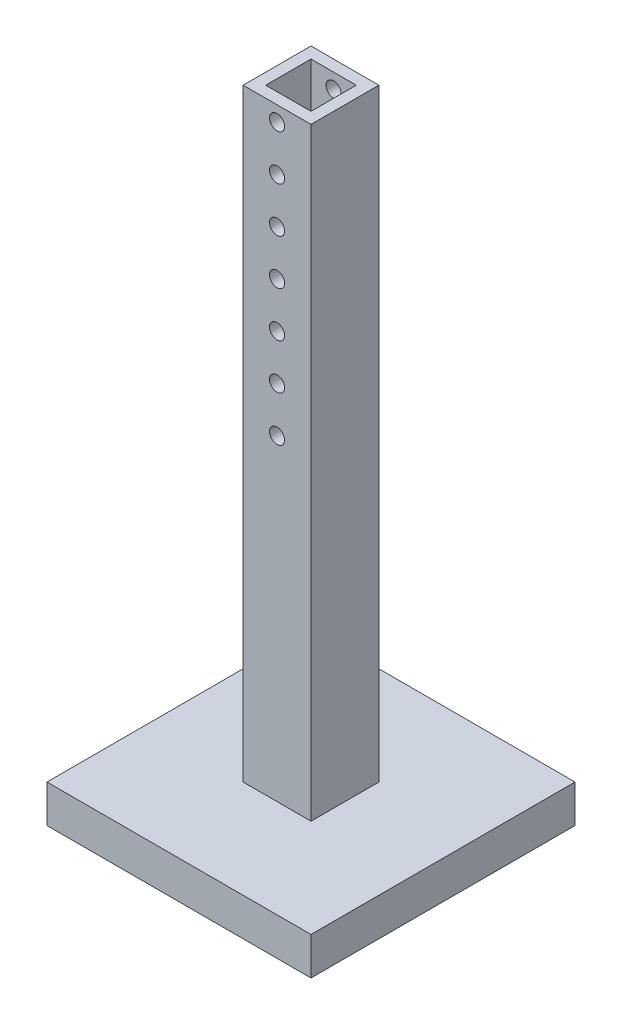
ISO-10303-21;
HEADER;
FILE_DESCRIPTION(('STEP AP214'),'2;1');
FILE_NAME('part.step','',(''),(''),'','','');
FILE_SCHEMA(('AUTOMOTIVE_DESIGN { 1 0 10303 214 1 1 1 1 }'));
ENDSEC;
DATA;
#1=APPLICATION_CONTEXT('core data for automotive mechanical design processes');
#2=APPLICATION_PROTOCOL_DEFINITION('international standard','automotive_design',2000,#1);
#3=PRODUCT_CONTEXT('',#1,'mechanical');
#4=PRODUCT('Part','Part','',(#3));
#5=PRODUCT_RELATED_PRODUCT_CATEGORY('part','',(#4));
#6=PRODUCT_DEFINITION_FORMATION('','',#4);
#7=PRODUCT_DEFINITION_CONTEXT('part definition',#1,'design');
#8=PRODUCT_DEFINITION('design','',#6,#7);
#9=PRODUCT_DEFINITION_SHAPE('','',#8);
#10=(LENGTH_UNIT() NAMED_UNIT(*) SI_UNIT(.MILLI.,.METRE.));
#11=(NAMED_UNIT(*) PLANE_ANGLE_UNIT() SI_UNIT($,.RADIAN.));
#12=(NAMED_UNIT(*) SI_UNIT($,.STERADIAN.) SOLID_ANGLE_UNIT());
#13=UNCERTAINTY_MEASURE_WITH_UNIT(LENGTH_MEASURE(1.E-05),#10,'distance_accuracy_value','');
#14=(GEOMETRIC_REPRESENTATION_CONTEXT(3) GLOBAL_UNCERTAINTY_ASSIGNED_CONTEXT((#13)) GLOBAL_UNIT_ASSIGNED_CONTEXT((#10,
#11,#12)) REPRESENTATION_CONTEXT('',''));
#15=CARTESIAN_POINT('',(0.,0.,0.));
#16=DIRECTION('',(0.,0.,1.));
#17=DIRECTION('',(1.,0.,0.));
#18=AXIS2_PLACEMENT_3D('',#15,#16,#17);
#19=CARTESIAN_POINT('',(175.,50.,-175.));
#20=DIRECTION('',(-1.,0.,0.));
#21=DIRECTION('',(0.,0.,1.));
#22=AXIS2_PLACEMENT_3D('',#19,#20,#21);
#23=PLANE('',#22);
#24=DIRECTION('',(0.,0.,-1.));
#25=VECTOR('',#24,1.);
#26=CARTESIAN_POINT('',(175.,0.,-175.));
#27=LINE('',#26,#25);
#28=CARTESIAN_POINT('',(175.,0.,175.));
#29=VERTEX_POINT('',#28);
#30=CARTESIAN_POINT('',(175.,0.,-175.));
#31=VERTEX_POINT('',#30);
#32=EDGE_CURVE('E226',#29,#31,#27,.T.);
#33=ORIENTED_EDGE('',*,*,#32,.T.);
#34=DIRECTION('',(0.,-1.,0.));
#35=VECTOR('',#34,1.);
#36=CARTESIAN_POINT('',(175.,50.,-175.));
#37=LINE('',#36,#35);
#38=CARTESIAN_POINT('',(175.,50.,-175.));
#39=VERTEX_POINT('',#38);
#40=EDGE_CURVE('E11',#39,#31,#37,.T.);
#41=ORIENTED_EDGE('',*,*,#40,.F.);
#42=DIRECTION('',(0.,0.,-1.));
#43=VECTOR('',#42,1.);
#44=CARTESIAN_POINT('',(175.,50.,-175.));
#45=LINE('',#44,#43);
#46=CARTESIAN_POINT('',(175.,50.,175.));
#47=VERTEX_POINT('',#46);
#48=EDGE_CURVE('E227',#47,#39,#45,.T.);
#49=ORIENTED_EDGE('',*,*,#48,.F.);
#50=DIRECTION('',(0.,-1.,0.));
#51=VECTOR('',#50,1.);
#52=CARTESIAN_POINT('',(175.,50.,175.));
#53=LINE('',#52,#51);
#54=EDGE_CURVE('E241',#47,#29,#53,.T.);
#55=ORIENTED_EDGE('',*,*,#54,.T.);
#56=EDGE_LOOP('',(#33,#41,#49,#55));
#57=FACE_BOUND('',#56,.T.);
#58=ADVANCED_FACE('F40',(#57),#23,.F.);
#59=CARTESIAN_POINT('',(-175.,50.,-175.));
#60=DIRECTION('',(0.,0.,1.));
#61=DIRECTION('',(1.,0.,0.));
#62=AXIS2_PLACEMENT_3D('',#59,#60,#61);
#63=PLANE('',#62);
#64=DIRECTION('',(-1.,0.,0.));
#65=VECTOR('',#64,1.);
#66=CARTESIAN_POINT('',(-175.,0.,-175.));
#67=LINE('',#66,#65);
#68=CARTESIAN_POINT('',(-175.,0.,-175.));
#69=VERTEX_POINT('',#68);
#70=EDGE_CURVE('E245',#31,#69,#67,.T.);
#71=ORIENTED_EDGE('',*,*,#70,.T.);
#72=DIRECTION('',(0.,-1.,0.));
#73=VECTOR('',#72,1.);
#74=CARTESIAN_POINT('',(-175.,50.,-175.));
#75=LINE('',#74,#73);
#76=CARTESIAN_POINT('',(-175.,50.,-175.));
#77=VERTEX_POINT('',#76);
#78=EDGE_CURVE('E49',#77,#69,#75,.T.);
#79=ORIENTED_EDGE('',*,*,#78,.F.);
#80=DIRECTION('',(-1.,0.,0.));
#81=VECTOR('',#80,1.);
#82=CARTESIAN_POINT('',(-175.,50.,-175.));
#83=LINE('',#82,#81);
#84=EDGE_CURVE('E231',#39,#77,#83,.T.);
#85=ORIENTED_EDGE('',*,*,#84,.F.);
#86=ORIENTED_EDGE('',*,*,#40,.T.);
#87=EDGE_LOOP('',(#71,#79,#85,#86));
#88=FACE_BOUND('',#87,.T.);
#89=ADVANCED_FACE('F385',(#88),#63,.F.);
#90=CARTESIAN_POINT('',(-175.,50.,-175.));
#91=DIRECTION('',(1.,0.,0.));
#92=DIRECTION('',(0.,0.,-1.));
#93=AXIS2_PLACEMENT_3D('',#90,#91,#92);
#94=PLANE('',#93);
#95=DIRECTION('',(0.,0.,1.));
#96=VECTOR('',#95,1.);
#97=CARTESIAN_POINT('',(-175.,0.,-175.));
#98=LINE('',#97,#96);
#99=CARTESIAN_POINT('',(-175.,0.,175.));
#100=VERTEX_POINT('',#99);
#101=EDGE_CURVE('E248',#69,#100,#98,.T.);
#102=ORIENTED_EDGE('',*,*,#101,.T.);
#103=DIRECTION('',(0.,-1.,0.));
#104=VECTOR('',#103,1.);
#105=CARTESIAN_POINT('',(-175.,50.,175.));
#106=LINE('',#105,#104);
#107=CARTESIAN_POINT('',(-175.,50.,175.));
#108=VERTEX_POINT('',#107);
#109=EDGE_CURVE('E256',#108,#100,#106,.T.);
#110=ORIENTED_EDGE('',*,*,#109,.F.);
#111=DIRECTION('',(0.,0.,1.));
#112=VECTOR('',#111,1.);
#113=CARTESIAN_POINT('',(-175.,50.,-175.));
#114=LINE('',#113,#112);
#115=EDGE_CURVE('E235',#77,#108,#114,.T.);
#116=ORIENTED_EDGE('',*,*,#115,.F.);
#117=ORIENTED_EDGE('',*,*,#78,.T.);
#118=EDGE_LOOP('',(#102,#110,#116,#117));
#119=FACE_BOUND('',#118,.T.);
#120=ADVANCED_FACE('F390',(#119),#94,.F.);
#121=CARTESIAN_POINT('',(-175.,50.,175.));
#122=DIRECTION('',(0.,0.,-1.));
#123=DIRECTION('',(-1.,0.,0.));
#124=AXIS2_PLACEMENT_3D('',#121,#122,#123);
#125=PLANE('',#124);
#126=DIRECTION('',(1.,0.,0.));
#127=VECTOR('',#126,1.);
#128=CARTESIAN_POINT('',(-175.,0.,175.));
#129=LINE('',#128,#127);
#130=EDGE_CURVE('E232',#100,#29,#129,.T.);
#131=ORIENTED_EDGE('',*,*,#130,.T.);
#132=ORIENTED_EDGE('',*,*,#54,.F.);
#133=DIRECTION('',(1.,0.,0.));
#134=VECTOR('',#133,1.);
#135=CARTESIAN_POINT('',(-175.,50.,175.));
#136=LINE('',#135,#134);
#137=EDGE_CURVE('E238',#108,#47,#136,.T.);
#138=ORIENTED_EDGE('',*,*,#137,.F.);
#139=ORIENTED_EDGE('',*,*,#109,.T.);
#140=EDGE_LOOP('',(#131,#132,#138,#139));
#141=FACE_BOUND('',#140,.T.);
#142=ADVANCED_FACE('F375',(#141),#125,.F.);
#143=CARTESIAN_POINT('',(0.,50.,0.));
#144=DIRECTION('',(0.,1.,0.));
#145=DIRECTION('',(0.,0.,1.));
#146=AXIS2_PLACEMENT_3D('',#143,#144,#145);
#147=PLANE('',#146);
#148=DIRECTION('',(0.,0.,-1.));
#149=VECTOR('',#148,1.);
#150=CARTESIAN_POINT('',(45.,50.,-45.));
#151=LINE('',#150,#149);
#152=CARTESIAN_POINT('',(45.,50.,45.));
#153=VERTEX_POINT('',#152);
#154=CARTESIAN_POINT('',(45.,50.,-45.));
#155=VERTEX_POINT('',#154);
#156=EDGE_CURVE('E65',#153,#155,#151,.T.);
#157=ORIENTED_EDGE('',*,*,#156,.F.);
#158=DIRECTION('',(1.,0.,0.));
#159=VECTOR('',#158,1.);
#160=CARTESIAN_POINT('',(-45.,50.,45.));
#161=LINE('',#160,#159);
#162=CARTESIAN_POINT('',(-45.,50.,45.));
#163=VERTEX_POINT('',#162);
#164=EDGE_CURVE('E189',#163,#153,#161,.T.);
#165=ORIENTED_EDGE('',*,*,#164,.F.);
#166=DIRECTION('',(0.,0.,1.));
#167=VECTOR('',#166,1.);
#168=CARTESIAN_POINT('',(-45.,50.,-45.));
#169=LINE('',#168,#167);
#170=CARTESIAN_POINT('',(-45.,50.,-45.));
#171=VERTEX_POINT('',#170);
#172=EDGE_CURVE('E205',#171,#163,#169,.T.);
#173=ORIENTED_EDGE('',*,*,#172,.F.);
#174=DIRECTION('',(-1.,0.,0.));
#175=VECTOR('',#174,1.);
#176=CARTESIAN_POINT('',(-45.,50.,-45.));
#177=LINE('',#176,#175);
#178=EDGE_CURVE('E201',#155,#171,#177,.T.);
#179=ORIENTED_EDGE('',*,*,#178,.F.);
#180=EDGE_LOOP('',(#157,#165,#173,#179));
#181=FACE_BOUND('',#180,.T.);
#182=ORIENTED_EDGE('',*,*,#48,.T.);
#183=ORIENTED_EDGE('',*,*,#84,.T.);
#184=ORIENTED_EDGE('',*,*,#115,.T.);
#185=ORIENTED_EDGE('',*,*,#137,.T.);
#186=EDGE_LOOP('',(#182,#183,#184,#185));
#187=FACE_BOUND('',#186,.T.);
#188=ADVANCED_FACE('F371',(#181,#187),#147,.T.);
#189=CARTESIAN_POINT('',(0.,0.,0.));
#190=DIRECTION('',(0.,1.,0.));
#191=DIRECTION('',(0.,0.,1.));
#192=AXIS2_PLACEMENT_3D('',#189,#190,#191);
#193=PLANE('',#192);
#194=ORIENTED_EDGE('',*,*,#32,.F.);
#195=ORIENTED_EDGE('',*,*,#130,.F.);
#196=ORIENTED_EDGE('',*,*,#101,.F.);
#197=ORIENTED_EDGE('',*,*,#70,.F.);
#198=EDGE_LOOP('',(#194,#195,#196,#197));
#199=FACE_BOUND('',#198,.T.);
#200=ADVANCED_FACE('F374',(#199),#193,.F.);
#201=CARTESIAN_POINT('',(45.,850.,-45.));
#202=DIRECTION('',(-1.,0.,0.));
#203=DIRECTION('',(0.,0.,1.));
#204=AXIS2_PLACEMENT_3D('',#201,#202,#203);
#205=PLANE('',#204);
#206=ORIENTED_EDGE('',*,*,#156,.T.);
#207=DIRECTION('',(0.,-1.,0.));
#208=VECTOR('',#207,1.);
#209=CARTESIAN_POINT('',(45.,850.,-45.));
#210=LINE('',#209,#208);
#211=CARTESIAN_POINT('',(45.,850.,-45.));
#212=VERTEX_POINT('',#211);
#213=EDGE_CURVE('E222',#212,#155,#210,.T.);
#214=ORIENTED_EDGE('',*,*,#213,.F.);
#215=DIRECTION('',(0.,0.,-1.));
#216=VECTOR('',#215,1.);
#217=CARTESIAN_POINT('',(45.,850.,-45.));
#218=LINE('',#217,#216);
#219=CARTESIAN_POINT('',(45.,850.,45.));
#220=VERTEX_POINT('',#219);
#221=EDGE_CURVE('E185',#220,#212,#218,.T.);
#222=ORIENTED_EDGE('',*,*,#221,.F.);
#223=DIRECTION('',(0.,-1.,0.));
#224=VECTOR('',#223,1.);
#225=CARTESIAN_POINT('',(45.,850.,45.));
#226=LINE('',#225,#224);
#227=EDGE_CURVE('E198',#220,#153,#226,.T.);
#228=ORIENTED_EDGE('',*,*,#227,.T.);
#229=EDGE_LOOP('',(#206,#214,#222,#228));
#230=FACE_BOUND('',#229,.T.);
#231=ADVANCED_FACE('F342',(#230),#205,.F.);
#232=CARTESIAN_POINT('',(-45.,850.,-45.));
#233=DIRECTION('',(0.,0.,1.));
#234=DIRECTION('',(1.,0.,0.));
#235=AXIS2_PLACEMENT_3D('',#232,#233,#234);
#236=PLANE('',#235);
#237=CARTESIAN_POINT('',(0.,830.,-45.));
#238=DIRECTION('',(0.,0.,1.));
#239=DIRECTION('',(1.,0.,0.));
#240=AXIS2_PLACEMENT_3D('',#237,#238,#239);
#241=CIRCLE('',#240,10.);
#242=CARTESIAN_POINT('',(10.,830.,-45.));
#243=VERTEX_POINT('',#242);
#244=EDGE_CURVE('E163',#243,#243,#241,.T.);
#245=ORIENTED_EDGE('',*,*,#244,.T.);
#246=EDGE_LOOP('',(#245));
#247=FACE_BOUND('',#246,.T.);
#248=CARTESIAN_POINT('',(0.,770.,-45.));
#249=DIRECTION('',(0.,0.,1.));
#250=DIRECTION('',(1.,0.,0.));
#251=AXIS2_PLACEMENT_3D('',#248,#249,#250);
#252=CIRCLE('',#251,10.);
#253=CARTESIAN_POINT('',(10.,770.,-45.));
#254=VERTEX_POINT('',#253);
#255=EDGE_CURVE('E302',#254,#254,#252,.T.);
#256=ORIENTED_EDGE('',*,*,#255,.T.);
#257=EDGE_LOOP('',(#256));
#258=FACE_BOUND('',#257,.T.);
#259=CARTESIAN_POINT('',(0.,710.,-45.));
#260=DIRECTION('',(0.,0.,1.));
#261=DIRECTION('',(1.,0.,0.));
#262=AXIS2_PLACEMENT_3D('',#259,#260,#261);
#263=CIRCLE('',#262,10.);
#264=CARTESIAN_POINT('',(10.,710.,-45.));
#265=VERTEX_POINT('',#264);
#266=EDGE_CURVE('E296',#265,#265,#263,.T.);
#267=ORIENTED_EDGE('',*,*,#266,.T.);
#268=EDGE_LOOP('',(#267));
#269=FACE_BOUND('',#268,.T.);
#270=CARTESIAN_POINT('',(0.,650.,-45.));
#271=DIRECTION('',(0.,0.,1.));
#272=DIRECTION('',(1.,0.,0.));
#273=AXIS2_PLACEMENT_3D('',#270,#271,#272);
#274=CIRCLE('',#273,10.);
#275=CARTESIAN_POINT('',(10.,650.,-45.));
#276=VERTEX_POINT('',#275);
#277=EDGE_CURVE('E291',#276,#276,#274,.T.);
#278=ORIENTED_EDGE('',*,*,#277,.T.);
#279=EDGE_LOOP('',(#278));
#280=FACE_BOUND('',#279,.T.);
#281=CARTESIAN_POINT('',(0.,590.,-45.));
#282=DIRECTION('',(0.,0.,1.));
#283=DIRECTION('',(1.,0.,0.));
#284=AXIS2_PLACEMENT_3D('',#281,#282,#283);
#285=CIRCLE('',#284,10.);
#286=CARTESIAN_POINT('',(10.,590.,-45.));
#287=VERTEX_POINT('',#286);
#288=EDGE_CURVE('E286',#287,#287,#285,.T.);
#289=ORIENTED_EDGE('',*,*,#288,.T.);
#290=EDGE_LOOP('',(#289));
#291=FACE_BOUND('',#290,.T.);
#292=CARTESIAN_POINT('',(0.,530.,-45.));
#293=DIRECTION('',(0.,0.,1.));
#294=DIRECTION('',(1.,0.,0.));
#295=AXIS2_PLACEMENT_3D('',#292,#293,#294);
#296=CIRCLE('',#295,10.);
#297=CARTESIAN_POINT('',(10.,530.,-45.));
#298=VERTEX_POINT('',#297);
#299=EDGE_CURVE('E280',#298,#298,#296,.T.);
#300=ORIENTED_EDGE('',*,*,#299,.T.);
#301=EDGE_LOOP('',(#300));
#302=FACE_BOUND('',#301,.T.);
#303=CARTESIAN_POINT('',(0.,470.,-45.));
#304=DIRECTION('',(0.,0.,1.));
#305=DIRECTION('',(1.,0.,0.));
#306=AXIS2_PLACEMENT_3D('',#303,#304,#305);
#307=CIRCLE('',#306,10.);
#308=CARTESIAN_POINT('',(10.,470.,-45.));
#309=VERTEX_POINT('',#308);
#310=EDGE_CURVE('E274',#309,#309,#307,.T.);
#311=ORIENTED_EDGE('',*,*,#310,.T.);
#312=EDGE_LOOP('',(#311));
#313=FACE_BOUND('',#312,.T.);
#314=ORIENTED_EDGE('',*,*,#178,.T.);
#315=DIRECTION('',(0.,-1.,0.));
#316=VECTOR('',#315,1.);
#317=CARTESIAN_POINT('',(-45.,850.,-45.));
#318=LINE('',#317,#316);
#319=CARTESIAN_POINT('',(-45.,850.,-45.));
#320=VERTEX_POINT('',#319);
#321=EDGE_CURVE('E218',#320,#171,#318,.T.);
#322=ORIENTED_EDGE('',*,*,#321,.F.);
#323=DIRECTION('',(-1.,0.,0.));
#324=VECTOR('',#323,1.);
#325=CARTESIAN_POINT('',(-45.,850.,-45.));
#326=LINE('',#325,#324);
#327=EDGE_CURVE('E188',#212,#320,#326,.T.);
#328=ORIENTED_EDGE('',*,*,#327,.F.);
#329=ORIENTED_EDGE('',*,*,#213,.T.);
#330=EDGE_LOOP('',(#314,#322,#328,#329));
#331=FACE_BOUND('',#330,.T.);
#332=ADVANCED_FACE('F338',(#247,#258,#269,#280,#291,#302,#313,#331),#236,.F.);
#333=CARTESIAN_POINT('',(-45.,850.,-45.));
#334=DIRECTION('',(1.,0.,0.));
#335=DIRECTION('',(0.,0.,-1.));
#336=AXIS2_PLACEMENT_3D('',#333,#334,#335);
#337=PLANE('',#336);
#338=ORIENTED_EDGE('',*,*,#172,.T.);
#339=DIRECTION('',(0.,-1.,0.));
#340=VECTOR('',#339,1.);
#341=CARTESIAN_POINT('',(-45.,850.,45.));
#342=LINE('',#341,#340);
#343=CARTESIAN_POINT('',(-45.,850.,45.));
#344=VERTEX_POINT('',#343);
#345=EDGE_CURVE('E214',#344,#163,#342,.T.);
#346=ORIENTED_EDGE('',*,*,#345,.F.);
#347=DIRECTION('',(0.,0.,1.));
#348=VECTOR('',#347,1.);
#349=CARTESIAN_POINT('',(-45.,850.,-45.));
#350=LINE('',#349,#348);
#351=EDGE_CURVE('E192',#320,#344,#350,.T.);
#352=ORIENTED_EDGE('',*,*,#351,.F.);
#353=ORIENTED_EDGE('',*,*,#321,.T.);
#354=EDGE_LOOP('',(#338,#346,#352,#353));
#355=FACE_BOUND('',#354,.T.);
#356=ADVANCED_FACE('F341',(#355),#337,.F.);
#357=CARTESIAN_POINT('',(-45.,850.,45.));
#358=DIRECTION('',(0.,0.,-1.));
#359=DIRECTION('',(-1.,0.,0.));
#360=AXIS2_PLACEMENT_3D('',#357,#358,#359);
#361=PLANE('',#360);
#362=CARTESIAN_POINT('',(0.,830.,45.));
#363=DIRECTION('',(0.,0.,1.));
#364=DIRECTION('',(1.,0.,0.));
#365=AXIS2_PLACEMENT_3D('',#362,#363,#364);
#366=CIRCLE('',#365,10.);
#367=CARTESIAN_POINT('',(10.,830.,45.));
#368=VERTEX_POINT('',#367);
#369=EDGE_CURVE('E268',#368,#368,#366,.T.);
#370=ORIENTED_EDGE('',*,*,#369,.F.);
#371=EDGE_LOOP('',(#370));
#372=FACE_BOUND('',#371,.T.);
#373=CARTESIAN_POINT('',(0.,770.,45.));
#374=DIRECTION('',(0.,0.,1.));
#375=DIRECTION('',(1.,0.,0.));
#376=AXIS2_PLACEMENT_3D('',#373,#374,#375);
#377=CIRCLE('',#376,10.);
#378=CARTESIAN_POINT('',(10.,770.,45.));
#379=VERTEX_POINT('',#378);
#380=EDGE_CURVE('E681',#379,#379,#377,.T.);
#381=ORIENTED_EDGE('',*,*,#380,.F.);
#382=EDGE_LOOP('',(#381));
#383=FACE_BOUND('',#382,.T.);
#384=CARTESIAN_POINT('',(0.,710.,45.));
#385=DIRECTION('',(0.,0.,1.));
#386=DIRECTION('',(1.,0.,0.));
#387=AXIS2_PLACEMENT_3D('',#384,#385,#386);
#388=CIRCLE('',#387,10.);
#389=CARTESIAN_POINT('',(10.,710.,45.));
#390=VERTEX_POINT('',#389);
#391=EDGE_CURVE('E686',#390,#390,#388,.T.);
#392=ORIENTED_EDGE('',*,*,#391,.F.);
#393=EDGE_LOOP('',(#392));
#394=FACE_BOUND('',#393,.T.);
#395=CARTESIAN_POINT('',(0.,650.,45.));
#396=DIRECTION('',(0.,0.,1.));
#397=DIRECTION('',(1.,0.,0.));
#398=AXIS2_PLACEMENT_3D('',#395,#396,#397);
#399=CIRCLE('',#398,10.);
#400=CARTESIAN_POINT('',(10.,650.,45.));
#401=VERTEX_POINT('',#400);
#402=EDGE_CURVE('E692',#401,#401,#399,.T.);
#403=ORIENTED_EDGE('',*,*,#402,.F.);
#404=EDGE_LOOP('',(#403));
#405=FACE_BOUND('',#404,.T.);
#406=CARTESIAN_POINT('',(0.,590.,45.));
#407=DIRECTION('',(0.,0.,1.));
#408=DIRECTION('',(1.,0.,0.));
#409=AXIS2_PLACEMENT_3D('',#406,#407,#408);
#410=CIRCLE('',#409,10.);
#411=CARTESIAN_POINT('',(10.,590.,45.));
#412=VERTEX_POINT('',#411);
#413=EDGE_CURVE('E696',#412,#412,#410,.T.);
#414=ORIENTED_EDGE('',*,*,#413,.F.);
#415=EDGE_LOOP('',(#414));
#416=FACE_BOUND('',#415,.T.);
#417=CARTESIAN_POINT('',(0.,530.,45.));
#418=DIRECTION('',(0.,0.,1.));
#419=DIRECTION('',(1.,0.,0.));
#420=AXIS2_PLACEMENT_3D('',#417,#418,#419);
#421=CIRCLE('',#420,10.);
#422=CARTESIAN_POINT('',(10.,530.,45.));
#423=VERTEX_POINT('',#422);
#424=EDGE_CURVE('E700',#423,#423,#421,.T.);
#425=ORIENTED_EDGE('',*,*,#424,.F.);
#426=EDGE_LOOP('',(#425));
#427=FACE_BOUND('',#426,.T.);
#428=CARTESIAN_POINT('',(0.,470.,45.));
#429=DIRECTION('',(0.,0.,1.));
#430=DIRECTION('',(1.,0.,0.));
#431=AXIS2_PLACEMENT_3D('',#428,#429,#430);
#432=CIRCLE('',#431,10.);
#433=CARTESIAN_POINT('',(10.,470.,45.));
#434=VERTEX_POINT('',#433);
#435=EDGE_CURVE('E704',#434,#434,#432,.T.);
#436=ORIENTED_EDGE('',*,*,#435,.F.);
#437=EDGE_LOOP('',(#436));
#438=FACE_BOUND('',#437,.T.);
#439=ORIENTED_EDGE('',*,*,#164,.T.);
#440=ORIENTED_EDGE('',*,*,#227,.F.);
#441=DIRECTION('',(1.,0.,0.));
#442=VECTOR('',#441,1.);
#443=CARTESIAN_POINT('',(-45.,850.,45.));
#444=LINE('',#443,#442);
#445=EDGE_CURVE('E195',#344,#220,#444,.T.);
#446=ORIENTED_EDGE('',*,*,#445,.F.);
#447=ORIENTED_EDGE('',*,*,#345,.T.);
#448=EDGE_LOOP('',(#439,#440,#446,#447));
#449=FACE_BOUND('',#448,.T.);
#450=ADVANCED_FACE('F370',(#372,#383,#394,#405,#416,#427,#438,#449),#361,.F.);
#451=CARTESIAN_POINT('',(0.,850.,0.));
#452=DIRECTION('',(0.,1.,0.));
#453=DIRECTION('',(0.,0.,1.));
#454=AXIS2_PLACEMENT_3D('',#451,#452,#453);
#455=PLANE('',#454);
#456=DIRECTION('',(0.,0.,-1.));
#457=VECTOR('',#456,1.);
#458=CARTESIAN_POINT('',(30.,850.,-30.));
#459=LINE('',#458,#457);
#460=CARTESIAN_POINT('',(30.,850.,30.));
#461=VERTEX_POINT('',#460);
#462=CARTESIAN_POINT('',(30.,850.,-30.));
#463=VERTEX_POINT('',#462);
#464=EDGE_CURVE('E57',#461,#463,#459,.T.);
#465=ORIENTED_EDGE('',*,*,#464,.F.);
#466=DIRECTION('',(1.,0.,0.));
#467=VECTOR('',#466,1.);
#468=CARTESIAN_POINT('',(-30.,850.,30.));
#469=LINE('',#468,#467);
#470=CARTESIAN_POINT('',(-30.,850.,30.));
#471=VERTEX_POINT('',#470);
#472=EDGE_CURVE('E154',#471,#461,#469,.T.);
#473=ORIENTED_EDGE('',*,*,#472,.F.);
#474=DIRECTION('',(0.,0.,1.));
#475=VECTOR('',#474,1.);
#476=CARTESIAN_POINT('',(-30.,850.,-30.));
#477=LINE('',#476,#475);
#478=CARTESIAN_POINT('',(-30.,850.,-30.));
#479=VERTEX_POINT('',#478);
#480=EDGE_CURVE('E160',#479,#471,#477,.T.);
#481=ORIENTED_EDGE('',*,*,#480,.F.);
#482=DIRECTION('',(-1.,0.,0.));
#483=VECTOR('',#482,1.);
#484=CARTESIAN_POINT('',(-30.,850.,-30.));
#485=LINE('',#484,#483);
#486=EDGE_CURVE('E172',#463,#479,#485,.T.);
#487=ORIENTED_EDGE('',*,*,#486,.F.);
#488=EDGE_LOOP('',(#465,#473,#481,#487));
#489=FACE_BOUND('',#488,.T.);
#490=ORIENTED_EDGE('',*,*,#221,.T.);
#491=ORIENTED_EDGE('',*,*,#327,.T.);
#492=ORIENTED_EDGE('',*,*,#351,.T.);
#493=ORIENTED_EDGE('',*,*,#445,.T.);
#494=EDGE_LOOP('',(#490,#491,#492,#493));
#495=FACE_BOUND('',#494,.T.);
#496=ADVANCED_FACE('F365',(#489,#495),#455,.T.);
#497=CARTESIAN_POINT('',(30.,50.,-30.));
#498=DIRECTION('',(1.,0.,0.));
#499=DIRECTION('',(0.,0.,-1.));
#500=AXIS2_PLACEMENT_3D('',#497,#498,#499);
#501=PLANE('',#500);
#502=ORIENTED_EDGE('',*,*,#464,.T.);
#503=DIRECTION('',(0.,1.,0.));
#504=VECTOR('',#503,1.);
#505=CARTESIAN_POINT('',(30.,50.,-30.));
#506=LINE('',#505,#504);
#507=CARTESIAN_POINT('',(30.,50.,-30.));
#508=VERTEX_POINT('',#507);
#509=EDGE_CURVE('E129',#508,#463,#506,.T.);
#510=ORIENTED_EDGE('',*,*,#509,.F.);
#511=DIRECTION('',(0.,0.,-1.));
#512=VECTOR('',#511,1.);
#513=CARTESIAN_POINT('',(30.,50.,-30.));
#514=LINE('',#513,#512);
#515=CARTESIAN_POINT('',(30.,50.,30.));
#516=VERTEX_POINT('',#515);
#517=EDGE_CURVE('E133',#516,#508,#514,.T.);
#518=ORIENTED_EDGE('',*,*,#517,.F.);
#519=DIRECTION('',(0.,1.,0.));
#520=VECTOR('',#519,1.);
#521=CARTESIAN_POINT('',(30.,50.,30.));
#522=LINE('',#521,#520);
#523=EDGE_CURVE('E178',#516,#461,#522,.T.);
#524=ORIENTED_EDGE('',*,*,#523,.T.);
#525=EDGE_LOOP('',(#502,#510,#518,#524));
#526=FACE_BOUND('',#525,.T.);
#527=ADVANCED_FACE('F131',(#526),#501,.F.);
#528=CARTESIAN_POINT('',(-30.,50.,30.));
#529=DIRECTION('',(0.,0.,1.));
#530=DIRECTION('',(1.,0.,0.));
#531=AXIS2_PLACEMENT_3D('',#528,#529,#530);
#532=PLANE('',#531);
#533=CARTESIAN_POINT('',(0.,830.,30.));
#534=DIRECTION('',(0.,0.,1.));
#535=DIRECTION('',(1.,0.,0.));
#536=AXIS2_PLACEMENT_3D('',#533,#534,#535);
#537=CIRCLE('',#536,10.);
#538=CARTESIAN_POINT('',(10.,830.,30.));
#539=VERTEX_POINT('',#538);
#540=EDGE_CURVE('E316',#539,#539,#537,.T.);
#541=ORIENTED_EDGE('',*,*,#540,.T.);
#542=EDGE_LOOP('',(#541));
#543=FACE_BOUND('',#542,.T.);
#544=CARTESIAN_POINT('',(0.,770.,30.));
#545=DIRECTION('',(0.,0.,1.));
#546=DIRECTION('',(1.,0.,0.));
#547=AXIS2_PLACEMENT_3D('',#544,#545,#546);
#548=CIRCLE('',#547,10.);
#549=CARTESIAN_POINT('',(10.,770.,30.));
#550=VERTEX_POINT('',#549);
#551=EDGE_CURVE('E295',#550,#550,#548,.T.);
#552=ORIENTED_EDGE('',*,*,#551,.T.);
#553=EDGE_LOOP('',(#552));
#554=FACE_BOUND('',#553,.T.);
#555=CARTESIAN_POINT('',(0.,710.,30.));
#556=DIRECTION('',(0.,0.,1.));
#557=DIRECTION('',(1.,0.,0.));
#558=AXIS2_PLACEMENT_3D('',#555,#556,#557);
#559=CIRCLE('',#558,10.);
#560=CARTESIAN_POINT('',(10.,710.,30.));
#561=VERTEX_POINT('',#560);
#562=EDGE_CURVE('E290',#561,#561,#559,.T.);
#563=ORIENTED_EDGE('',*,*,#562,.T.);
#564=EDGE_LOOP('',(#563));
#565=FACE_BOUND('',#564,.T.);
#566=CARTESIAN_POINT('',(0.,650.,30.));
#567=DIRECTION('',(0.,0.,1.));
#568=DIRECTION('',(1.,0.,0.));
#569=AXIS2_PLACEMENT_3D('',#566,#567,#568);
#570=CIRCLE('',#569,10.);
#571=CARTESIAN_POINT('',(10.,650.,30.));
#572=VERTEX_POINT('',#571);
#573=EDGE_CURVE('E285',#572,#572,#570,.T.);
#574=ORIENTED_EDGE('',*,*,#573,.T.);
#575=EDGE_LOOP('',(#574));
#576=FACE_BOUND('',#575,.T.);
#577=CARTESIAN_POINT('',(0.,590.,30.));
#578=DIRECTION('',(0.,0.,1.));
#579=DIRECTION('',(1.,0.,0.));
#580=AXIS2_PLACEMENT_3D('',#577,#578,#579);
#581=CIRCLE('',#580,10.);
#582=CARTESIAN_POINT('',(10.,590.,30.));
#583=VERTEX_POINT('',#582);
#584=EDGE_CURVE('E279',#583,#583,#581,.T.);
#585=ORIENTED_EDGE('',*,*,#584,.T.);
#586=EDGE_LOOP('',(#585));
#587=FACE_BOUND('',#586,.T.);
#588=CARTESIAN_POINT('',(0.,530.,30.));
#589=DIRECTION('',(0.,0.,1.));
#590=DIRECTION('',(1.,0.,0.));
#591=AXIS2_PLACEMENT_3D('',#588,#589,#590);
#592=CIRCLE('',#591,10.);
#593=CARTESIAN_POINT('',(10.,530.,30.));
#594=VERTEX_POINT('',#593);
#595=EDGE_CURVE('E273',#594,#594,#592,.T.);
#596=ORIENTED_EDGE('',*,*,#595,.T.);
#597=EDGE_LOOP('',(#596));
#598=FACE_BOUND('',#597,.T.);
#599=CARTESIAN_POINT('',(0.,470.,30.));
#600=DIRECTION('',(0.,0.,1.));
#601=DIRECTION('',(1.,0.,0.));
#602=AXIS2_PLACEMENT_3D('',#599,#600,#601);
#603=CIRCLE('',#602,10.);
#604=CARTESIAN_POINT('',(10.,470.,30.));
#605=VERTEX_POINT('',#604);
#606=EDGE_CURVE('E267',#605,#605,#603,.T.);
#607=ORIENTED_EDGE('',*,*,#606,.T.);
#608=EDGE_LOOP('',(#607));
#609=FACE_BOUND('',#608,.T.);
#610=ORIENTED_EDGE('',*,*,#472,.T.);
#611=ORIENTED_EDGE('',*,*,#523,.F.);
#612=DIRECTION('',(1.,0.,0.));
#613=VECTOR('',#612,1.);
#614=CARTESIAN_POINT('',(-30.,50.,30.));
#615=LINE('',#614,#613);
#616=CARTESIAN_POINT('',(-30.,50.,30.));
#617=VERTEX_POINT('',#616);
#618=EDGE_CURVE('E140',#617,#516,#615,.T.);
#619=ORIENTED_EDGE('',*,*,#618,.F.);
#620=DIRECTION('',(0.,1.,0.));
#621=VECTOR('',#620,1.);
#622=CARTESIAN_POINT('',(-30.,50.,30.));
#623=LINE('',#622,#621);
#624=EDGE_CURVE('E181',#617,#471,#623,.T.);
#625=ORIENTED_EDGE('',*,*,#624,.T.);
#626=EDGE_LOOP('',(#610,#611,#619,#625));
#627=FACE_BOUND('',#626,.T.);
#628=ADVANCED_FACE('F462',(#543,#554,#565,#576,#587,#598,#609,#627),#532,.F.);
#629=CARTESIAN_POINT('',(-30.,50.,-30.));
#630=DIRECTION('',(-1.,0.,0.));
#631=DIRECTION('',(0.,0.,1.));
#632=AXIS2_PLACEMENT_3D('',#629,#630,#631);
#633=PLANE('',#632);
#634=ORIENTED_EDGE('',*,*,#480,.T.);
#635=ORIENTED_EDGE('',*,*,#624,.F.);
#636=DIRECTION('',(0.,0.,1.));
#637=VECTOR('',#636,1.);
#638=CARTESIAN_POINT('',(-30.,50.,-30.));
#639=LINE('',#638,#637);
#640=CARTESIAN_POINT('',(-30.,50.,-30.));
#641=VERTEX_POINT('',#640);
#642=EDGE_CURVE('E149',#641,#617,#639,.T.);
#643=ORIENTED_EDGE('',*,*,#642,.F.);
#644=DIRECTION('',(0.,1.,0.));
#645=VECTOR('',#644,1.);
#646=CARTESIAN_POINT('',(-30.,50.,-30.));
#647=LINE('',#646,#645);
#648=EDGE_CURVE('E139',#641,#479,#647,.T.);
#649=ORIENTED_EDGE('',*,*,#648,.T.);
#650=EDGE_LOOP('',(#634,#635,#643,#649));
#651=FACE_BOUND('',#650,.T.);
#652=ADVANCED_FACE('F470',(#651),#633,.F.);
#653=CARTESIAN_POINT('',(-30.,50.,-30.));
#654=DIRECTION('',(0.,0.,-1.));
#655=DIRECTION('',(-1.,0.,0.));
#656=AXIS2_PLACEMENT_3D('',#653,#654,#655);
#657=PLANE('',#656);
#658=CARTESIAN_POINT('',(0.,830.,-30.));
#659=DIRECTION('',(0.,0.,-1.));
#660=DIRECTION('',(-1.,0.,0.));
#661=AXIS2_PLACEMENT_3D('',#658,#659,#660);
#662=CIRCLE('',#661,10.);
#663=CARTESIAN_POINT('',(-10.,830.,-30.));
#664=VERTEX_POINT('',#663);
#665=EDGE_CURVE('E43',#664,#664,#662,.T.);
#666=ORIENTED_EDGE('',*,*,#665,.T.);
#667=EDGE_LOOP('',(#666));
#668=FACE_BOUND('',#667,.T.);
#669=CARTESIAN_POINT('',(0.,770.,-30.));
#670=DIRECTION('',(0.,0.,-1.));
#671=DIRECTION('',(-1.,0.,0.));
#672=AXIS2_PLACEMENT_3D('',#669,#670,#671);
#673=CIRCLE('',#672,10.);
#674=CARTESIAN_POINT('',(-10.,770.,-30.));
#675=VERTEX_POINT('',#674);
#676=EDGE_CURVE('E292',#675,#675,#673,.T.);
#677=ORIENTED_EDGE('',*,*,#676,.T.);
#678=EDGE_LOOP('',(#677));
#679=FACE_BOUND('',#678,.T.);
#680=CARTESIAN_POINT('',(0.,710.,-30.));
#681=DIRECTION('',(0.,0.,-1.));
#682=DIRECTION('',(-1.,0.,0.));
#683=AXIS2_PLACEMENT_3D('',#680,#681,#682);
#684=CIRCLE('',#683,10.);
#685=CARTESIAN_POINT('',(-10.,710.,-30.));
#686=VERTEX_POINT('',#685);
#687=EDGE_CURVE('E287',#686,#686,#684,.T.);
#688=ORIENTED_EDGE('',*,*,#687,.T.);
#689=EDGE_LOOP('',(#688));
#690=FACE_BOUND('',#689,.T.);
#691=CARTESIAN_POINT('',(0.,650.,-30.));
#692=DIRECTION('',(0.,0.,-1.));
#693=DIRECTION('',(-1.,0.,0.));
#694=AXIS2_PLACEMENT_3D('',#691,#692,#693);
#695=CIRCLE('',#694,10.);
#696=CARTESIAN_POINT('',(-10.,650.,-30.));
#697=VERTEX_POINT('',#696);
#698=EDGE_CURVE('E281',#697,#697,#695,.T.);
#699=ORIENTED_EDGE('',*,*,#698,.T.);
#700=EDGE_LOOP('',(#699));
#701=FACE_BOUND('',#700,.T.);
#702=CARTESIAN_POINT('',(0.,590.,-30.));
#703=DIRECTION('',(0.,0.,-1.));
#704=DIRECTION('',(-1.,0.,0.));
#705=AXIS2_PLACEMENT_3D('',#702,#703,#704);
#706=CIRCLE('',#705,10.);
#707=CARTESIAN_POINT('',(-10.,590.,-30.));
#708=VERTEX_POINT('',#707);
#709=EDGE_CURVE('E275',#708,#708,#706,.T.);
#710=ORIENTED_EDGE('',*,*,#709,.T.);
#711=EDGE_LOOP('',(#710));
#712=FACE_BOUND('',#711,.T.);
#713=CARTESIAN_POINT('',(0.,530.,-30.));
#714=DIRECTION('',(0.,0.,-1.));
#715=DIRECTION('',(-1.,0.,0.));
#716=AXIS2_PLACEMENT_3D('',#713,#714,#715);
#717=CIRCLE('',#716,10.);
#718=CARTESIAN_POINT('',(-10.,530.,-30.));
#719=VERTEX_POINT('',#718);
#720=EDGE_CURVE('E269',#719,#719,#717,.T.);
#721=ORIENTED_EDGE('',*,*,#720,.T.);
#722=EDGE_LOOP('',(#721));
#723=FACE_BOUND('',#722,.T.);
#724=CARTESIAN_POINT('',(0.,470.,-30.));
#725=DIRECTION('',(0.,0.,-1.));
#726=DIRECTION('',(-1.,0.,0.));
#727=AXIS2_PLACEMENT_3D('',#724,#725,#726);
#728=CIRCLE('',#727,10.);
#729=CARTESIAN_POINT('',(-10.,470.,-30.));
#730=VERTEX_POINT('',#729);
#731=EDGE_CURVE('E263',#730,#730,#728,.T.);
#732=ORIENTED_EDGE('',*,*,#731,.T.);
#733=EDGE_LOOP('',(#732));
#734=FACE_BOUND('',#733,.T.);
#735=ORIENTED_EDGE('',*,*,#486,.T.);
#736=ORIENTED_EDGE('',*,*,#648,.F.);
#737=DIRECTION('',(-1.,0.,0.));
#738=VECTOR('',#737,1.);
#739=CARTESIAN_POINT('',(-30.,50.,-30.));
#740=LINE('',#739,#738);
#741=EDGE_CURVE('E143',#508,#641,#740,.T.);
#742=ORIENTED_EDGE('',*,*,#741,.F.);
#743=ORIENTED_EDGE('',*,*,#509,.T.);
#744=EDGE_LOOP('',(#735,#736,#742,#743));
#745=FACE_BOUND('',#744,.T.);
#746=ADVANCED_FACE('F144',(#668,#679,#690,#701,#712,#723,#734,#745),#657,.F.);
#747=CARTESIAN_POINT('',(0.,50.,0.));
#748=DIRECTION('',(0.,1.,0.));
#749=DIRECTION('',(0.,0.,1.));
#750=AXIS2_PLACEMENT_3D('',#747,#748,#749);
#751=PLANE('',#750);
#752=ORIENTED_EDGE('',*,*,#517,.T.);
#753=ORIENTED_EDGE('',*,*,#741,.T.);
#754=ORIENTED_EDGE('',*,*,#642,.T.);
#755=ORIENTED_EDGE('',*,*,#618,.T.);
#756=EDGE_LOOP('',(#752,#753,#754,#755));
#757=FACE_BOUND('',#756,.T.);
#758=ADVANCED_FACE('F151',(#757),#751,.T.);
#759=CARTESIAN_POINT('',(0.,470.,-175.));
#760=DIRECTION('',(0.,0.,1.));
#761=DIRECTION('',(1.,0.,0.));
#762=AXIS2_PLACEMENT_3D('',#759,#760,#761);
#763=CYLINDRICAL_SURFACE('',#762,10.);
#764=ORIENTED_EDGE('',*,*,#731,.F.);
#765=EDGE_LOOP('',(#764));
#766=FACE_BOUND('',#765,.T.);
#767=ORIENTED_EDGE('',*,*,#310,.F.);
#768=EDGE_LOOP('',(#767));
#769=FACE_BOUND('',#768,.T.);
#770=ADVANCED_FACE('F492',(#766,#769),#763,.F.);
#771=CARTESIAN_POINT('',(0.,530.,-175.));
#772=DIRECTION('',(0.,0.,1.));
#773=DIRECTION('',(1.,0.,0.));
#774=AXIS2_PLACEMENT_3D('',#771,#772,#773);
#775=CYLINDRICAL_SURFACE('',#774,10.);
#776=ORIENTED_EDGE('',*,*,#720,.F.);
#777=EDGE_LOOP('',(#776));
#778=FACE_BOUND('',#777,.T.);
#779=ORIENTED_EDGE('',*,*,#299,.F.);
#780=EDGE_LOOP('',(#779));
#781=FACE_BOUND('',#780,.T.);
#782=ADVANCED_FACE('F499',(#778,#781),#775,.F.);
#783=CARTESIAN_POINT('',(0.,590.,-175.));
#784=DIRECTION('',(0.,0.,1.));
#785=DIRECTION('',(1.,0.,0.));
#786=AXIS2_PLACEMENT_3D('',#783,#784,#785);
#787=CYLINDRICAL_SURFACE('',#786,10.);
#788=ORIENTED_EDGE('',*,*,#709,.F.);
#789=EDGE_LOOP('',(#788));
#790=FACE_BOUND('',#789,.T.);
#791=ORIENTED_EDGE('',*,*,#288,.F.);
#792=EDGE_LOOP('',(#791));
#793=FACE_BOUND('',#792,.T.);
#794=ADVANCED_FACE('F508',(#790,#793),#787,.F.);
#795=CARTESIAN_POINT('',(0.,650.,-175.));
#796=DIRECTION('',(0.,0.,1.));
#797=DIRECTION('',(1.,0.,0.));
#798=AXIS2_PLACEMENT_3D('',#795,#796,#797);
#799=CYLINDRICAL_SURFACE('',#798,10.);
#800=ORIENTED_EDGE('',*,*,#698,.F.);
#801=EDGE_LOOP('',(#800));
#802=FACE_BOUND('',#801,.T.);
#803=ORIENTED_EDGE('',*,*,#277,.F.);
#804=EDGE_LOOP('',(#803));
#805=FACE_BOUND('',#804,.T.);
#806=ADVANCED_FACE('F518',(#802,#805),#799,.F.);
#807=CARTESIAN_POINT('',(0.,710.,-175.));
#808=DIRECTION('',(0.,0.,1.));
#809=DIRECTION('',(1.,0.,0.));
#810=AXIS2_PLACEMENT_3D('',#807,#808,#809);
#811=CYLINDRICAL_SURFACE('',#810,10.);
#812=ORIENTED_EDGE('',*,*,#687,.F.);
#813=EDGE_LOOP('',(#812));
#814=FACE_BOUND('',#813,.T.);
#815=ORIENTED_EDGE('',*,*,#266,.F.);
#816=EDGE_LOOP('',(#815));
#817=FACE_BOUND('',#816,.T.);
#818=ADVANCED_FACE('F528',(#814,#817),#811,.F.);
#819=CARTESIAN_POINT('',(0.,770.,-175.));
#820=DIRECTION('',(0.,0.,1.));
#821=DIRECTION('',(1.,0.,0.));
#822=AXIS2_PLACEMENT_3D('',#819,#820,#821);
#823=CYLINDRICAL_SURFACE('',#822,10.);
#824=ORIENTED_EDGE('',*,*,#676,.F.);
#825=EDGE_LOOP('',(#824));
#826=FACE_BOUND('',#825,.T.);
#827=ORIENTED_EDGE('',*,*,#255,.F.);
#828=EDGE_LOOP('',(#827));
#829=FACE_BOUND('',#828,.T.);
#830=ADVANCED_FACE('F333',(#826,#829),#823,.F.);
#831=CARTESIAN_POINT('',(0.,830.,-175.));
#832=DIRECTION('',(0.,0.,1.));
#833=DIRECTION('',(1.,0.,0.));
#834=AXIS2_PLACEMENT_3D('',#831,#832,#833);
#835=CYLINDRICAL_SURFACE('',#834,10.);
#836=ORIENTED_EDGE('',*,*,#665,.F.);
#837=EDGE_LOOP('',(#836));
#838=FACE_BOUND('',#837,.T.);
#839=ORIENTED_EDGE('',*,*,#244,.F.);
#840=EDGE_LOOP('',(#839));
#841=FACE_BOUND('',#840,.T.);
#842=ADVANCED_FACE('F329',(#838,#841),#835,.F.);
#843=ORIENTED_EDGE('',*,*,#435,.T.);
#844=EDGE_LOOP('',(#843));
#845=FACE_BOUND('',#844,.T.);
#846=ORIENTED_EDGE('',*,*,#606,.F.);
#847=EDGE_LOOP('',(#846));
#848=FACE_BOUND('',#847,.T.);
#849=ADVANCED_FACE('F332',(#845,#848),#763,.F.);
#850=ORIENTED_EDGE('',*,*,#424,.T.);
#851=EDGE_LOOP('',(#850));
#852=FACE_BOUND('',#851,.T.);
#853=ORIENTED_EDGE('',*,*,#595,.F.);
#854=EDGE_LOOP('',(#853));
#855=FACE_BOUND('',#854,.T.);
#856=ADVANCED_FACE('F511',(#852,#855),#775,.F.);
#857=ORIENTED_EDGE('',*,*,#413,.T.);
#858=EDGE_LOOP('',(#857));
#859=FACE_BOUND('',#858,.T.);
#860=ORIENTED_EDGE('',*,*,#584,.F.);
#861=EDGE_LOOP('',(#860));
#862=FACE_BOUND('',#861,.T.);
#863=ADVANCED_FACE('F521',(#859,#862),#787,.F.);
#864=ORIENTED_EDGE('',*,*,#402,.T.);
#865=EDGE_LOOP('',(#864));
#866=FACE_BOUND('',#865,.T.);
#867=ORIENTED_EDGE('',*,*,#573,.F.);
#868=EDGE_LOOP('',(#867));
#869=FACE_BOUND('',#868,.T.);
#870=ADVANCED_FACE('F531',(#866,#869),#799,.F.);
#871=ORIENTED_EDGE('',*,*,#391,.T.);
#872=EDGE_LOOP('',(#871));
#873=FACE_BOUND('',#872,.T.);
#874=ORIENTED_EDGE('',*,*,#562,.F.);
#875=EDGE_LOOP('',(#874));
#876=FACE_BOUND('',#875,.T.);
#877=ADVANCED_FACE('F540',(#873,#876),#811,.F.);
#878=ORIENTED_EDGE('',*,*,#380,.T.);
#879=EDGE_LOOP('',(#878));
#880=FACE_BOUND('',#879,.T.);
#881=ORIENTED_EDGE('',*,*,#551,.F.);
#882=EDGE_LOOP('',(#881));
#883=FACE_BOUND('',#882,.T.);
#884=ADVANCED_FACE('F549',(#880,#883),#823,.F.);
#885=ORIENTED_EDGE('',*,*,#369,.T.);
#886=EDGE_LOOP('',(#885));
#887=FACE_BOUND('',#886,.T.);
#888=ORIENTED_EDGE('',*,*,#540,.F.);
#889=EDGE_LOOP('',(#888));
#890=FACE_BOUND('',#889,.T.);
#891=ADVANCED_FACE('F335',(#887,#890),#835,.F.);
#892=CLOSED_SHELL('',(#58,#89,#120,#142,#188,#200,#231,#332,#356,#450,#496,#527,#628,#652,#746,
#758,#770,#782,#794,#806,#818,#830,#842,#849,#856,#863,#870,#877,#884,#891));
#893=MANIFOLD_SOLID_BREP('B2',#892);
#894=ADVANCED_BREP_SHAPE_REPRESENTATION('',(#18,#893),#14);
#895=SHAPE_DEFINITION_REPRESENTATION(#9,#894);
ENDSEC;
END-ISO-10303-21;
